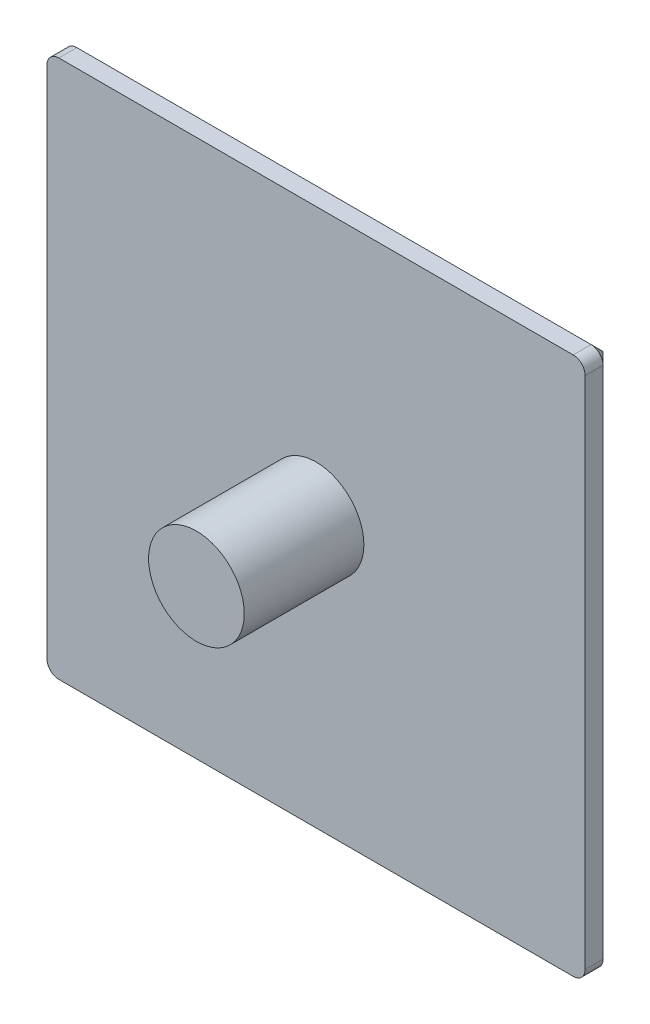
ISO-10303-21;
HEADER;
FILE_DESCRIPTION(('STEP AP214'),'2;1');
FILE_NAME('part.step','',(''),(''),'','','');
FILE_SCHEMA(('AUTOMOTIVE_DESIGN { 1 0 10303 214 1 1 1 1 }'));
ENDSEC;
DATA;
#1=APPLICATION_CONTEXT('core data for automotive mechanical design processes');
#2=APPLICATION_PROTOCOL_DEFINITION('international standard','automotive_design',2000,#1);
#3=PRODUCT_CONTEXT('',#1,'mechanical');
#4=PRODUCT('Part','Part','',(#3));
#5=PRODUCT_RELATED_PRODUCT_CATEGORY('part','',(#4));
#6=PRODUCT_DEFINITION_FORMATION('','',#4);
#7=PRODUCT_DEFINITION_CONTEXT('part definition',#1,'design');
#8=PRODUCT_DEFINITION('design','',#6,#7);
#9=PRODUCT_DEFINITION_SHAPE('','',#8);
#10=(LENGTH_UNIT() NAMED_UNIT(*) SI_UNIT(.MILLI.,.METRE.));
#11=(NAMED_UNIT(*) PLANE_ANGLE_UNIT() SI_UNIT($,.RADIAN.));
#12=(NAMED_UNIT(*) SI_UNIT($,.STERADIAN.) SOLID_ANGLE_UNIT());
#13=UNCERTAINTY_MEASURE_WITH_UNIT(LENGTH_MEASURE(1.E-05),#10,'distance_accuracy_value','');
#14=(GEOMETRIC_REPRESENTATION_CONTEXT(3) GLOBAL_UNCERTAINTY_ASSIGNED_CONTEXT((#13)) GLOBAL_UNIT_ASSIGNED_CONTEXT((#10,
#11,#12)) REPRESENTATION_CONTEXT('',''));
#15=CARTESIAN_POINT('',(0.,0.,0.));
#16=DIRECTION('',(0.,0.,1.));
#17=DIRECTION('',(1.,0.,0.));
#18=AXIS2_PLACEMENT_3D('',#15,#16,#17);
#19=CARTESIAN_POINT('',(-22.5,-22.5,2.5));
#20=DIRECTION('',(1.,0.,0.));
#21=DIRECTION('',(0.,0.,-1.));
#22=AXIS2_PLACEMENT_3D('',#19,#20,#21);
#23=PLANE('',#22);
#24=DIRECTION('',(0.,0.,-1.));
#25=VECTOR('',#24,1.);
#26=CARTESIAN_POINT('',(-22.5,21.5,2.5));
#27=LINE('',#26,#25);
#28=CARTESIAN_POINT('',(-22.5,21.5,2.5));
#29=VERTEX_POINT('',#28);
#30=CARTESIAN_POINT('',(-22.5,21.5,1.));
#31=VERTEX_POINT('',#30);
#32=EDGE_CURVE('E132',#29,#31,#27,.T.);
#33=ORIENTED_EDGE('',*,*,#32,.T.);
#34=DIRECTION('',(0.,-1.,0.));
#35=VECTOR('',#34,1.);
#36=CARTESIAN_POINT('',(-22.5,-22.5,1.));
#37=LINE('',#36,#35);
#38=CARTESIAN_POINT('',(-22.5,-21.5,1.));
#39=VERTEX_POINT('',#38);
#40=EDGE_CURVE('E57',#31,#39,#37,.T.);
#41=ORIENTED_EDGE('',*,*,#40,.T.);
#42=DIRECTION('',(0.,0.,-1.));
#43=VECTOR('',#42,1.);
#44=CARTESIAN_POINT('',(-22.5,-21.5,2.5));
#45=LINE('',#44,#43);
#46=CARTESIAN_POINT('',(-22.5,-21.5,2.5));
#47=VERTEX_POINT('',#46);
#48=EDGE_CURVE('E134',#39,#47,#45,.F.);
#49=ORIENTED_EDGE('',*,*,#48,.T.);
#50=DIRECTION('',(0.,-1.,0.));
#51=VECTOR('',#50,1.);
#52=CARTESIAN_POINT('',(-22.5,-22.5,2.5));
#53=LINE('',#52,#51);
#54=EDGE_CURVE('E119',#29,#47,#53,.T.);
#55=ORIENTED_EDGE('',*,*,#54,.F.);
#56=EDGE_LOOP('',(#33,#41,#49,#55));
#57=FACE_BOUND('',#56,.T.);
#58=ADVANCED_FACE('F33',(#57),#23,.F.);
#59=CARTESIAN_POINT('',(22.5,-22.5,2.5));
#60=DIRECTION('',(0.,1.,0.));
#61=DIRECTION('',(-1.,0.,0.));
#62=AXIS2_PLACEMENT_3D('',#59,#60,#61);
#63=PLANE('',#62);
#64=DIRECTION('',(0.,0.,-1.));
#65=VECTOR('',#64,1.);
#66=CARTESIAN_POINT('',(-21.5,-22.5,2.5));
#67=LINE('',#66,#65);
#68=CARTESIAN_POINT('',(-21.5,-22.5,2.5));
#69=VERTEX_POINT('',#68);
#70=CARTESIAN_POINT('',(-21.5,-22.5,1.));
#71=VERTEX_POINT('',#70);
#72=EDGE_CURVE('E125',#69,#71,#67,.T.);
#73=ORIENTED_EDGE('',*,*,#72,.T.);
#74=DIRECTION('',(1.,0.,0.));
#75=VECTOR('',#74,1.);
#76=CARTESIAN_POINT('',(22.5,-22.5,1.));
#77=LINE('',#76,#75);
#78=CARTESIAN_POINT('',(21.5,-22.5,1.));
#79=VERTEX_POINT('',#78);
#80=EDGE_CURVE('E11',#71,#79,#77,.T.);
#81=ORIENTED_EDGE('',*,*,#80,.T.);
#82=DIRECTION('',(0.,0.,-1.));
#83=VECTOR('',#82,1.);
#84=CARTESIAN_POINT('',(21.5,-22.5,2.5));
#85=LINE('',#84,#83);
#86=CARTESIAN_POINT('',(21.5,-22.5,2.5));
#87=VERTEX_POINT('',#86);
#88=EDGE_CURVE('E128',#79,#87,#85,.F.);
#89=ORIENTED_EDGE('',*,*,#88,.T.);
#90=DIRECTION('',(1.,0.,0.));
#91=VECTOR('',#90,1.);
#92=CARTESIAN_POINT('',(22.5,-22.5,2.5));
#93=LINE('',#92,#91);
#94=EDGE_CURVE('E116',#69,#87,#93,.T.);
#95=ORIENTED_EDGE('',*,*,#94,.F.);
#96=EDGE_LOOP('',(#73,#81,#89,#95));
#97=FACE_BOUND('',#96,.T.);
#98=ADVANCED_FACE('F124',(#97),#63,.F.);
#99=CARTESIAN_POINT('',(22.5,-22.5,2.5));
#100=DIRECTION('',(-1.,0.,0.));
#101=DIRECTION('',(0.,0.,1.));
#102=AXIS2_PLACEMENT_3D('',#99,#100,#101);
#103=PLANE('',#102);
#104=DIRECTION('',(0.,0.,-1.));
#105=VECTOR('',#104,1.);
#106=CARTESIAN_POINT('',(22.5,-21.5,2.5));
#107=LINE('',#106,#105);
#108=CARTESIAN_POINT('',(22.5,-21.5,2.5));
#109=VERTEX_POINT('',#108);
#110=CARTESIAN_POINT('',(22.5,-21.5,1.));
#111=VERTEX_POINT('',#110);
#112=EDGE_CURVE('E147',#109,#111,#107,.T.);
#113=ORIENTED_EDGE('',*,*,#112,.T.);
#114=DIRECTION('',(0.,1.,0.));
#115=VECTOR('',#114,1.);
#116=CARTESIAN_POINT('',(22.5,-22.5,1.));
#117=LINE('',#116,#115);
#118=CARTESIAN_POINT('',(22.5,21.5,1.));
#119=VERTEX_POINT('',#118);
#120=EDGE_CURVE('E158',#111,#119,#117,.T.);
#121=ORIENTED_EDGE('',*,*,#120,.T.);
#122=DIRECTION('',(0.,0.,-1.));
#123=VECTOR('',#122,1.);
#124=CARTESIAN_POINT('',(22.5,21.5,2.5));
#125=LINE('',#124,#123);
#126=CARTESIAN_POINT('',(22.5,21.5,2.5));
#127=VERTEX_POINT('',#126);
#128=EDGE_CURVE('E120',#119,#127,#125,.F.);
#129=ORIENTED_EDGE('',*,*,#128,.T.);
#130=DIRECTION('',(0.,1.,0.));
#131=VECTOR('',#130,1.);
#132=CARTESIAN_POINT('',(22.5,-22.5,2.5));
#133=LINE('',#132,#131);
#134=EDGE_CURVE('E129',#109,#127,#133,.T.);
#135=ORIENTED_EDGE('',*,*,#134,.F.);
#136=EDGE_LOOP('',(#113,#121,#129,#135));
#137=FACE_BOUND('',#136,.T.);
#138=ADVANCED_FACE('F248',(#137),#103,.F.);
#139=CARTESIAN_POINT('',(22.5,22.5,2.5));
#140=DIRECTION('',(0.,-1.,0.));
#141=DIRECTION('',(1.,0.,0.));
#142=AXIS2_PLACEMENT_3D('',#139,#140,#141);
#143=PLANE('',#142);
#144=DIRECTION('',(0.,0.,-1.));
#145=VECTOR('',#144,1.);
#146=CARTESIAN_POINT('',(21.5,22.5,2.5));
#147=LINE('',#146,#145);
#148=CARTESIAN_POINT('',(21.5,22.5,2.5));
#149=VERTEX_POINT('',#148);
#150=CARTESIAN_POINT('',(21.5,22.5,1.));
#151=VERTEX_POINT('',#150);
#152=EDGE_CURVE('E150',#149,#151,#147,.T.);
#153=ORIENTED_EDGE('',*,*,#152,.T.);
#154=DIRECTION('',(-1.,0.,0.));
#155=VECTOR('',#154,1.);
#156=CARTESIAN_POINT('',(22.5,22.5,1.));
#157=LINE('',#156,#155);
#158=CARTESIAN_POINT('',(-21.5,22.5,1.));
#159=VERTEX_POINT('',#158);
#160=EDGE_CURVE('E171',#151,#159,#157,.T.);
#161=ORIENTED_EDGE('',*,*,#160,.T.);
#162=DIRECTION('',(0.,0.,-1.));
#163=VECTOR('',#162,1.);
#164=CARTESIAN_POINT('',(-21.5,22.5,2.5));
#165=LINE('',#164,#163);
#166=CARTESIAN_POINT('',(-21.5,22.5,2.5));
#167=VERTEX_POINT('',#166);
#168=EDGE_CURVE('E153',#159,#167,#165,.F.);
#169=ORIENTED_EDGE('',*,*,#168,.T.);
#170=DIRECTION('',(-1.,0.,0.));
#171=VECTOR('',#170,1.);
#172=CARTESIAN_POINT('',(22.5,22.5,2.5));
#173=LINE('',#172,#171);
#174=EDGE_CURVE('E136',#149,#167,#173,.T.);
#175=ORIENTED_EDGE('',*,*,#174,.F.);
#176=EDGE_LOOP('',(#153,#161,#169,#175));
#177=FACE_BOUND('',#176,.T.);
#178=ADVANCED_FACE('F257',(#177),#143,.F.);
#179=CARTESIAN_POINT('',(0.,0.,2.5));
#180=DIRECTION('',(0.,0.,1.));
#181=DIRECTION('',(1.,0.,0.));
#182=AXIS2_PLACEMENT_3D('',#179,#180,#181);
#183=PLANE('',#182);
#184=CARTESIAN_POINT('',(0.,0.,2.5));
#185=DIRECTION('',(0.,0.,1.));
#186=DIRECTION('',(1.,0.,0.));
#187=AXIS2_PLACEMENT_3D('',#184,#185,#186);
#188=CIRCLE('',#187,4.);
#189=CARTESIAN_POINT('',(4.,0.,2.5));
#190=VERTEX_POINT('',#189);
#191=EDGE_CURVE('E199',#190,#190,#188,.T.);
#192=ORIENTED_EDGE('',*,*,#191,.F.);
#193=EDGE_LOOP('',(#192));
#194=FACE_BOUND('',#193,.T.);
#195=ORIENTED_EDGE('',*,*,#54,.T.);
#196=CARTESIAN_POINT('',(-21.5,-21.5,2.5));
#197=DIRECTION('',(0.,0.,1.));
#198=DIRECTION('',(1.,0.,0.));
#199=AXIS2_PLACEMENT_3D('',#196,#197,#198);
#200=CIRCLE('',#199,1.);
#201=EDGE_CURVE('E113',#47,#69,#200,.T.);
#202=ORIENTED_EDGE('',*,*,#201,.T.);
#203=ORIENTED_EDGE('',*,*,#94,.T.);
#204=CARTESIAN_POINT('',(21.5,-21.5,2.5));
#205=DIRECTION('',(0.,0.,1.));
#206=DIRECTION('',(1.,0.,0.));
#207=AXIS2_PLACEMENT_3D('',#204,#205,#206);
#208=CIRCLE('',#207,1.);
#209=EDGE_CURVE('E121',#87,#109,#208,.T.);
#210=ORIENTED_EDGE('',*,*,#209,.T.);
#211=ORIENTED_EDGE('',*,*,#134,.T.);
#212=CARTESIAN_POINT('',(21.5,21.5,2.5));
#213=DIRECTION('',(0.,0.,1.));
#214=DIRECTION('',(1.,0.,0.));
#215=AXIS2_PLACEMENT_3D('',#212,#213,#214);
#216=CIRCLE('',#215,1.);
#217=EDGE_CURVE('E141',#127,#149,#216,.T.);
#218=ORIENTED_EDGE('',*,*,#217,.T.);
#219=ORIENTED_EDGE('',*,*,#174,.T.);
#220=CARTESIAN_POINT('',(-21.5,21.5,2.5));
#221=DIRECTION('',(0.,0.,1.));
#222=DIRECTION('',(1.,0.,0.));
#223=AXIS2_PLACEMENT_3D('',#220,#221,#222);
#224=CIRCLE('',#223,1.);
#225=EDGE_CURVE('E143',#167,#29,#224,.T.);
#226=ORIENTED_EDGE('',*,*,#225,.T.);
#227=EDGE_LOOP('',(#195,#202,#203,#210,#211,#218,#219,#226));
#228=FACE_BOUND('',#227,.T.);
#229=ADVANCED_FACE('F115',(#194,#228),#183,.T.);
#230=CARTESIAN_POINT('',(0.,0.,0.));
#231=DIRECTION('',(0.,0.,1.));
#232=DIRECTION('',(1.,0.,0.));
#233=AXIS2_PLACEMENT_3D('',#230,#231,#232);
#234=PLANE('',#233);
#235=DIRECTION('',(1.,0.,0.));
#236=VECTOR('',#235,1.);
#237=CARTESIAN_POINT('',(0.,21.5,0.));
#238=LINE('',#237,#236);
#239=CARTESIAN_POINT('',(-21.5,21.5,0.));
#240=VERTEX_POINT('',#239);
#241=CARTESIAN_POINT('',(21.5,21.5,0.));
#242=VERTEX_POINT('',#241);
#243=EDGE_CURVE('E164',#240,#242,#238,.T.);
#244=ORIENTED_EDGE('',*,*,#243,.T.);
#245=DIRECTION('',(0.,-1.,0.));
#246=VECTOR('',#245,1.);
#247=CARTESIAN_POINT('',(21.5,0.,0.));
#248=LINE('',#247,#246);
#249=CARTESIAN_POINT('',(21.5,-21.5,0.));
#250=VERTEX_POINT('',#249);
#251=EDGE_CURVE('E166',#242,#250,#248,.T.);
#252=ORIENTED_EDGE('',*,*,#251,.T.);
#253=DIRECTION('',(-1.,0.,0.));
#254=VECTOR('',#253,1.);
#255=CARTESIAN_POINT('',(0.,-21.5,0.));
#256=LINE('',#255,#254);
#257=CARTESIAN_POINT('',(-21.5,-21.5,0.));
#258=VERTEX_POINT('',#257);
#259=EDGE_CURVE('E160',#250,#258,#256,.T.);
#260=ORIENTED_EDGE('',*,*,#259,.T.);
#261=DIRECTION('',(0.,1.,0.));
#262=VECTOR('',#261,1.);
#263=CARTESIAN_POINT('',(-21.5,0.,0.));
#264=LINE('',#263,#262);
#265=EDGE_CURVE('E162',#258,#240,#264,.T.);
#266=ORIENTED_EDGE('',*,*,#265,.T.);
#267=EDGE_LOOP('',(#244,#252,#260,#266));
#268=FACE_BOUND('',#267,.T.);
#269=ADVANCED_FACE('F264',(#268),#234,.F.);
#270=CARTESIAN_POINT('',(-21.5,-21.5,2.5));
#271=DIRECTION('',(0.,0.,-1.));
#272=DIRECTION('',(-1.,0.,0.));
#273=AXIS2_PLACEMENT_3D('',#270,#271,#272);
#274=CYLINDRICAL_SURFACE('',#273,1.);
#275=ORIENTED_EDGE('',*,*,#48,.F.);
#276=CARTESIAN_POINT('',(-21.5,-21.5,1.));
#277=DIRECTION('',(0.,0.,1.));
#278=DIRECTION('',(1.,0.,0.));
#279=AXIS2_PLACEMENT_3D('',#276,#277,#278);
#280=CIRCLE('',#279,1.);
#281=EDGE_CURVE('E42',#39,#71,#280,.T.);
#282=ORIENTED_EDGE('',*,*,#281,.T.);
#283=ORIENTED_EDGE('',*,*,#72,.F.);
#284=ORIENTED_EDGE('',*,*,#201,.F.);
#285=EDGE_LOOP('',(#275,#282,#283,#284));
#286=FACE_BOUND('',#285,.T.);
#287=ADVANCED_FACE('F131',(#286),#274,.T.);
#288=CARTESIAN_POINT('',(21.5,-21.5,2.5));
#289=DIRECTION('',(0.,0.,-1.));
#290=DIRECTION('',(-1.,0.,0.));
#291=AXIS2_PLACEMENT_3D('',#288,#289,#290);
#292=CYLINDRICAL_SURFACE('',#291,1.);
#293=ORIENTED_EDGE('',*,*,#88,.F.);
#294=CARTESIAN_POINT('',(21.5,-21.5,1.));
#295=DIRECTION('',(0.,0.,1.));
#296=DIRECTION('',(1.,0.,0.));
#297=AXIS2_PLACEMENT_3D('',#294,#295,#296);
#298=CIRCLE('',#297,1.);
#299=EDGE_CURVE('E155',#79,#111,#298,.T.);
#300=ORIENTED_EDGE('',*,*,#299,.T.);
#301=ORIENTED_EDGE('',*,*,#112,.F.);
#302=ORIENTED_EDGE('',*,*,#209,.F.);
#303=EDGE_LOOP('',(#293,#300,#301,#302));
#304=FACE_BOUND('',#303,.T.);
#305=ADVANCED_FACE('F236',(#304),#292,.T.);
#306=CARTESIAN_POINT('',(-21.5,21.5,2.5));
#307=DIRECTION('',(0.,0.,-1.));
#308=DIRECTION('',(-1.,0.,0.));
#309=AXIS2_PLACEMENT_3D('',#306,#307,#308);
#310=CYLINDRICAL_SURFACE('',#309,1.);
#311=ORIENTED_EDGE('',*,*,#168,.F.);
#312=CARTESIAN_POINT('',(-21.5,21.5,1.));
#313=DIRECTION('',(0.,0.,1.));
#314=DIRECTION('',(1.,0.,0.));
#315=AXIS2_PLACEMENT_3D('',#312,#313,#314);
#316=CIRCLE('',#315,1.);
#317=EDGE_CURVE('E173',#159,#31,#316,.T.);
#318=ORIENTED_EDGE('',*,*,#317,.T.);
#319=ORIENTED_EDGE('',*,*,#32,.F.);
#320=ORIENTED_EDGE('',*,*,#225,.F.);
#321=EDGE_LOOP('',(#311,#318,#319,#320));
#322=FACE_BOUND('',#321,.T.);
#323=ADVANCED_FACE('F222',(#322),#310,.T.);
#324=CARTESIAN_POINT('',(21.5,21.5,2.5));
#325=DIRECTION('',(0.,0.,-1.));
#326=DIRECTION('',(-1.,0.,0.));
#327=AXIS2_PLACEMENT_3D('',#324,#325,#326);
#328=CYLINDRICAL_SURFACE('',#327,1.);
#329=ORIENTED_EDGE('',*,*,#128,.F.);
#330=CARTESIAN_POINT('',(21.5,21.5,1.));
#331=DIRECTION('',(0.,0.,1.));
#332=DIRECTION('',(1.,0.,0.));
#333=AXIS2_PLACEMENT_3D('',#330,#331,#332);
#334=CIRCLE('',#333,1.);
#335=EDGE_CURVE('E169',#119,#151,#334,.T.);
#336=ORIENTED_EDGE('',*,*,#335,.T.);
#337=ORIENTED_EDGE('',*,*,#152,.F.);
#338=ORIENTED_EDGE('',*,*,#217,.F.);
#339=EDGE_LOOP('',(#329,#336,#337,#338));
#340=FACE_BOUND('',#339,.T.);
#341=ADVANCED_FACE('F252',(#340),#328,.T.);
#342=CARTESIAN_POINT('',(0.,0.,12.5));
#343=DIRECTION('',(0.,0.,-1.));
#344=DIRECTION('',(-1.,0.,0.));
#345=AXIS2_PLACEMENT_3D('',#342,#343,#344);
#346=CYLINDRICAL_SURFACE('',#345,4.);
#347=CARTESIAN_POINT('',(0.,0.,12.5));
#348=DIRECTION('',(0.,0.,1.));
#349=DIRECTION('',(1.,0.,0.));
#350=AXIS2_PLACEMENT_3D('',#347,#348,#349);
#351=CIRCLE('',#350,4.);
#352=CARTESIAN_POINT('',(4.,0.,12.5));
#353=VERTEX_POINT('',#352);
#354=EDGE_CURVE('E204',#353,#353,#351,.T.);
#355=ORIENTED_EDGE('',*,*,#354,.F.);
#356=EDGE_LOOP('',(#355));
#357=FACE_BOUND('',#356,.T.);
#358=ORIENTED_EDGE('',*,*,#191,.T.);
#359=EDGE_LOOP('',(#358));
#360=FACE_BOUND('',#359,.T.);
#361=ADVANCED_FACE('F284',(#357,#360),#346,.T.);
#362=CARTESIAN_POINT('',(0.,0.,12.5));
#363=DIRECTION('',(0.,0.,1.));
#364=DIRECTION('',(1.,0.,0.));
#365=AXIS2_PLACEMENT_3D('',#362,#363,#364);
#366=PLANE('',#365);
#367=ORIENTED_EDGE('',*,*,#354,.T.);
#368=EDGE_LOOP('',(#367));
#369=FACE_BOUND('',#368,.T.);
#370=ADVANCED_FACE('F300',(#369),#366,.T.);
#371=CARTESIAN_POINT('',(-21.5,21.5,1.));
#372=DIRECTION('',(0.,0.,1.));
#373=DIRECTION('',(1.,0.,0.));
#374=AXIS2_PLACEMENT_3D('',#371,#372,#373);
#375=CONICAL_SURFACE('',#374,1.00000000000001,0.785398163397452);
#376=DIRECTION('',(0.70710678118655,0.,-0.707106781186545));
#377=VECTOR('',#376,1.);
#378=CARTESIAN_POINT('',(-22.5,21.5,1.));
#379=LINE('',#378,#377);
#380=EDGE_CURVE('E192',#31,#240,#379,.T.);
#381=ORIENTED_EDGE('',*,*,#380,.F.);
#382=ORIENTED_EDGE('',*,*,#317,.F.);
#383=DIRECTION('',(0.,0.70710678118655,0.707106781186545));
#384=VECTOR('',#383,1.);
#385=CARTESIAN_POINT('',(-21.5,21.5,0.));
#386=LINE('',#385,#384);
#387=EDGE_CURVE('E37',#240,#159,#386,.T.);
#388=ORIENTED_EDGE('',*,*,#387,.F.);
#389=EDGE_LOOP('',(#381,#382,#388));
#390=FACE_BOUND('',#389,.T.);
#391=ADVANCED_FACE('F35',(#390),#375,.T.);
#392=CARTESIAN_POINT('',(22.5,22.5,1.));
#393=DIRECTION('',(0.,-0.707106781186545,0.70710678118655));
#394=DIRECTION('',(-1.,0.,0.));
#395=AXIS2_PLACEMENT_3D('',#392,#393,#394);
#396=PLANE('',#395);
#397=ORIENTED_EDGE('',*,*,#387,.T.);
#398=ORIENTED_EDGE('',*,*,#160,.F.);
#399=DIRECTION('',(0.,0.70710678118655,0.707106781186545));
#400=VECTOR('',#399,1.);
#401=CARTESIAN_POINT('',(21.5,21.5,0.));
#402=LINE('',#401,#400);
#403=EDGE_CURVE('E190',#242,#151,#402,.T.);
#404=ORIENTED_EDGE('',*,*,#403,.F.);
#405=ORIENTED_EDGE('',*,*,#243,.F.);
#406=EDGE_LOOP('',(#397,#398,#404,#405));
#407=FACE_BOUND('',#406,.T.);
#408=ADVANCED_FACE('F256',(#407),#396,.F.);
#409=CARTESIAN_POINT('',(-22.5,-22.5,1.));
#410=DIRECTION('',(0.707106781186545,0.,0.70710678118655));
#411=DIRECTION('',(0.,-1.,0.));
#412=AXIS2_PLACEMENT_3D('',#409,#410,#411);
#413=PLANE('',#412);
#414=ORIENTED_EDGE('',*,*,#380,.T.);
#415=ORIENTED_EDGE('',*,*,#265,.F.);
#416=DIRECTION('',(0.70710678118655,0.,-0.707106781186545));
#417=VECTOR('',#416,1.);
#418=CARTESIAN_POINT('',(-22.5,-21.5,1.));
#419=LINE('',#418,#417);
#420=EDGE_CURVE('E187',#39,#258,#419,.T.);
#421=ORIENTED_EDGE('',*,*,#420,.F.);
#422=ORIENTED_EDGE('',*,*,#40,.F.);
#423=EDGE_LOOP('',(#414,#415,#421,#422));
#424=FACE_BOUND('',#423,.T.);
#425=ADVANCED_FACE('F226',(#424),#413,.F.);
#426=CARTESIAN_POINT('',(21.5,21.5,1.));
#427=DIRECTION('',(0.,0.,1.));
#428=DIRECTION('',(1.,0.,0.));
#429=AXIS2_PLACEMENT_3D('',#426,#427,#428);
#430=CONICAL_SURFACE('',#429,1.00000000000001,0.785398163397452);
#431=ORIENTED_EDGE('',*,*,#403,.T.);
#432=ORIENTED_EDGE('',*,*,#335,.F.);
#433=DIRECTION('',(0.70710678118655,0.,0.707106781186545));
#434=VECTOR('',#433,1.);
#435=CARTESIAN_POINT('',(21.5,21.5,0.));
#436=LINE('',#435,#434);
#437=EDGE_CURVE('E184',#242,#119,#436,.T.);
#438=ORIENTED_EDGE('',*,*,#437,.F.);
#439=EDGE_LOOP('',(#431,#432,#438));
#440=FACE_BOUND('',#439,.T.);
#441=ADVANCED_FACE('F254',(#440),#430,.T.);
#442=CARTESIAN_POINT('',(-21.5,-21.5,1.));
#443=DIRECTION('',(0.,0.,1.));
#444=DIRECTION('',(1.,0.,0.));
#445=AXIS2_PLACEMENT_3D('',#442,#443,#444);
#446=CONICAL_SURFACE('',#445,1.00000000000001,0.785398163397452);
#447=ORIENTED_EDGE('',*,*,#281,.F.);
#448=ORIENTED_EDGE('',*,*,#420,.T.);
#449=DIRECTION('',(0.,0.70710678118655,-0.707106781186545));
#450=VECTOR('',#449,1.);
#451=CARTESIAN_POINT('',(-21.5,-22.5,1.));
#452=LINE('',#451,#450);
#453=EDGE_CURVE('E181',#71,#258,#452,.T.);
#454=ORIENTED_EDGE('',*,*,#453,.F.);
#455=EDGE_LOOP('',(#447,#448,#454));
#456=FACE_BOUND('',#455,.T.);
#457=ADVANCED_FACE('F228',(#456),#446,.T.);
#458=CARTESIAN_POINT('',(22.5,-22.5,1.));
#459=DIRECTION('',(-0.707106781186545,0.,0.70710678118655));
#460=DIRECTION('',(0.,1.,0.));
#461=AXIS2_PLACEMENT_3D('',#458,#459,#460);
#462=PLANE('',#461);
#463=ORIENTED_EDGE('',*,*,#437,.T.);
#464=ORIENTED_EDGE('',*,*,#120,.F.);
#465=DIRECTION('',(0.70710678118655,0.,0.707106781186545));
#466=VECTOR('',#465,1.);
#467=CARTESIAN_POINT('',(21.5,-21.5,0.));
#468=LINE('',#467,#466);
#469=EDGE_CURVE('E179',#250,#111,#468,.T.);
#470=ORIENTED_EDGE('',*,*,#469,.F.);
#471=ORIENTED_EDGE('',*,*,#251,.F.);
#472=EDGE_LOOP('',(#463,#464,#470,#471));
#473=FACE_BOUND('',#472,.T.);
#474=ADVANCED_FACE('F244',(#473),#462,.F.);
#475=CARTESIAN_POINT('',(22.5,-22.5,1.));
#476=DIRECTION('',(0.,0.707106781186545,0.70710678118655));
#477=DIRECTION('',(1.,0.,0.));
#478=AXIS2_PLACEMENT_3D('',#475,#476,#477);
#479=PLANE('',#478);
#480=ORIENTED_EDGE('',*,*,#453,.T.);
#481=ORIENTED_EDGE('',*,*,#259,.F.);
#482=DIRECTION('',(0.,0.70710678118655,-0.707106781186545));
#483=VECTOR('',#482,1.);
#484=CARTESIAN_POINT('',(21.5,-22.5,1.));
#485=LINE('',#484,#483);
#486=EDGE_CURVE('E177',#79,#250,#485,.T.);
#487=ORIENTED_EDGE('',*,*,#486,.F.);
#488=ORIENTED_EDGE('',*,*,#80,.F.);
#489=EDGE_LOOP('',(#480,#481,#487,#488));
#490=FACE_BOUND('',#489,.T.);
#491=ADVANCED_FACE('F233',(#490),#479,.F.);
#492=CARTESIAN_POINT('',(21.5,-21.5,1.));
#493=DIRECTION('',(0.,0.,1.));
#494=DIRECTION('',(1.,0.,0.));
#495=AXIS2_PLACEMENT_3D('',#492,#493,#494);
#496=CONICAL_SURFACE('',#495,1.00000000000001,0.785398163397452);
#497=ORIENTED_EDGE('',*,*,#469,.T.);
#498=ORIENTED_EDGE('',*,*,#299,.F.);
#499=ORIENTED_EDGE('',*,*,#486,.T.);
#500=EDGE_LOOP('',(#497,#498,#499));
#501=FACE_BOUND('',#500,.T.);
#502=ADVANCED_FACE('F239',(#501),#496,.T.);
#503=CLOSED_SHELL('',(#58,#98,#138,#178,#229,#269,#287,#305,#323,#341,#361,#370,#391,#408,#425,
#441,#457,#474,#491,#502));
#504=MANIFOLD_SOLID_BREP('B2',#503);
#505=ADVANCED_BREP_SHAPE_REPRESENTATION('',(#18,#504),#14);
#506=SHAPE_DEFINITION_REPRESENTATION(#9,#505);
ENDSEC;
END-ISO-10303-21;
